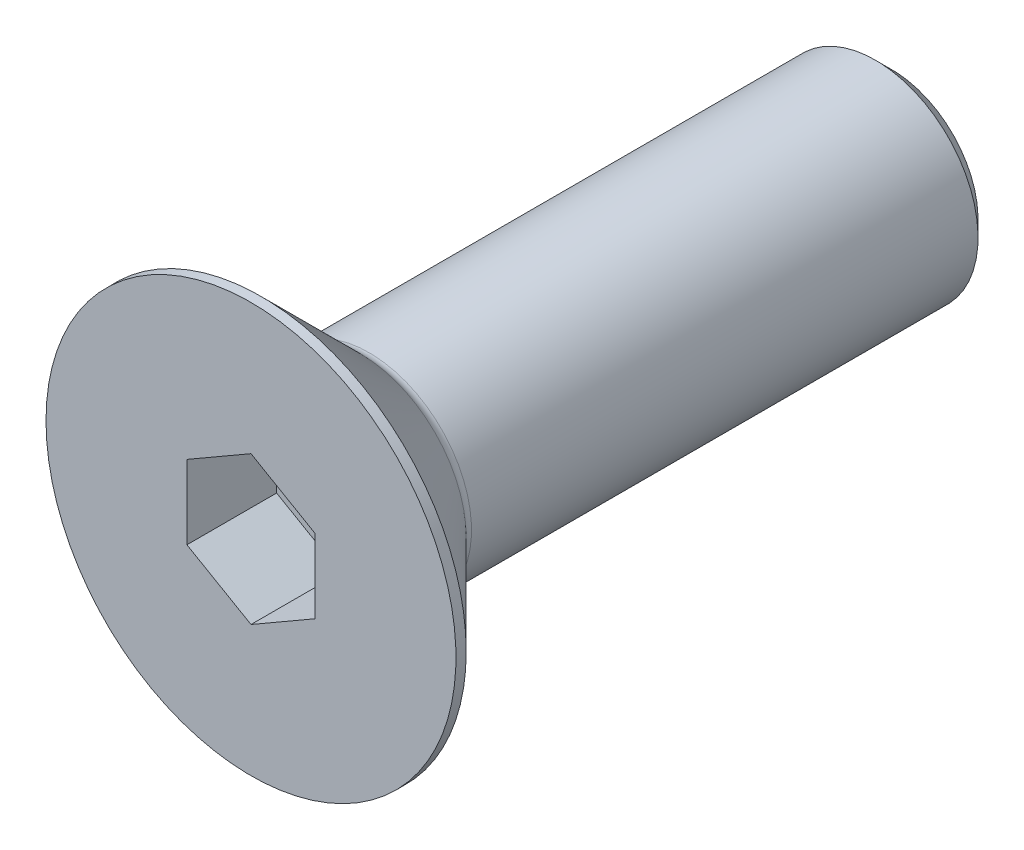
ISO-10303-21;
HEADER;
FILE_DESCRIPTION(('STEP AP214'),'2;1');
FILE_NAME('part.step','',(''),(''),'','','');
FILE_SCHEMA(('AUTOMOTIVE_DESIGN { 1 0 10303 214 1 1 1 1 }'));
ENDSEC;
DATA;
#1=APPLICATION_CONTEXT('core data for automotive mechanical design processes');
#2=APPLICATION_PROTOCOL_DEFINITION('international standard','automotive_design',2000,#1);
#3=PRODUCT_CONTEXT('',#1,'mechanical');
#4=PRODUCT('Part','Part','',(#3));
#5=PRODUCT_RELATED_PRODUCT_CATEGORY('part','',(#4));
#6=PRODUCT_DEFINITION_FORMATION('','',#4);
#7=PRODUCT_DEFINITION_CONTEXT('part definition',#1,'design');
#8=PRODUCT_DEFINITION('design','',#6,#7);
#9=PRODUCT_DEFINITION_SHAPE('','',#8);
#10=(LENGTH_UNIT() NAMED_UNIT(*) SI_UNIT(.MILLI.,.METRE.));
#11=(NAMED_UNIT(*) PLANE_ANGLE_UNIT() SI_UNIT($,.RADIAN.));
#12=(NAMED_UNIT(*) SI_UNIT($,.STERADIAN.) SOLID_ANGLE_UNIT());
#13=UNCERTAINTY_MEASURE_WITH_UNIT(LENGTH_MEASURE(1.E-05),#10,'distance_accuracy_value','');
#14=(GEOMETRIC_REPRESENTATION_CONTEXT(3) GLOBAL_UNCERTAINTY_ASSIGNED_CONTEXT((#13)) GLOBAL_UNIT_ASSIGNED_CONTEXT((#10,
#11,#12)) REPRESENTATION_CONTEXT('',''));
#15=CARTESIAN_POINT('',(0.,0.,0.));
#16=DIRECTION('',(0.,0.,1.));
#17=DIRECTION('',(1.,0.,0.));
#18=AXIS2_PLACEMENT_3D('',#15,#16,#17);
#19=CARTESIAN_POINT('',(0.,0.,-3.5));
#20=DIRECTION('',(0.,0.,1.));
#21=DIRECTION('',(1.,0.,0.));
#22=AXIS2_PLACEMENT_3D('',#19,#20,#21);
#23=PLANE('',#22);
#24=DIRECTION('',(-0.866025403784439,-0.5,0.));
#25=VECTOR('',#24,1.);
#26=CARTESIAN_POINT('',(0.,2.88675134594813,-3.5));
#27=LINE('',#26,#25);
#28=CARTESIAN_POINT('',(0.,2.88675134594813,-3.5));
#29=VERTEX_POINT('',#28);
#30=CARTESIAN_POINT('',(-2.5,1.44337567297406,-3.5));
#31=VERTEX_POINT('',#30);
#32=EDGE_CURVE('E82',#29,#31,#27,.T.);
#33=ORIENTED_EDGE('',*,*,#32,.T.);
#34=DIRECTION('',(0.,1.,0.));
#35=VECTOR('',#34,1.);
#36=CARTESIAN_POINT('',(-2.5,1.44337567297406,-3.5));
#37=LINE('',#36,#35);
#38=CARTESIAN_POINT('',(-2.5,-1.44337567297407,-3.5));
#39=VERTEX_POINT('',#38);
#40=EDGE_CURVE('E66',#31,#39,#37,.F.);
#41=ORIENTED_EDGE('',*,*,#40,.T.);
#42=DIRECTION('',(0.866025403784439,-0.499999999999999,0.));
#43=VECTOR('',#42,1.);
#44=CARTESIAN_POINT('',(-2.5,-1.44337567297407,-3.5));
#45=LINE('',#44,#43);
#46=CARTESIAN_POINT('',(0.,-2.88675134594813,-3.5));
#47=VERTEX_POINT('',#46);
#48=EDGE_CURVE('E71',#39,#47,#45,.T.);
#49=ORIENTED_EDGE('',*,*,#48,.T.);
#50=DIRECTION('',(0.866025403784439,0.5,0.));
#51=VECTOR('',#50,1.);
#52=CARTESIAN_POINT('',(0.,-2.88675134594813,-3.5));
#53=LINE('',#52,#51);
#54=CARTESIAN_POINT('',(2.5,-1.44337567297406,-3.5));
#55=VERTEX_POINT('',#54);
#56=EDGE_CURVE('E128',#47,#55,#53,.T.);
#57=ORIENTED_EDGE('',*,*,#56,.T.);
#58=DIRECTION('',(0.,1.,0.));
#59=VECTOR('',#58,1.);
#60=CARTESIAN_POINT('',(2.5,-1.44337567297406,-3.5));
#61=LINE('',#60,#59);
#62=CARTESIAN_POINT('',(2.5,1.44337567297407,-3.5));
#63=VERTEX_POINT('',#62);
#64=EDGE_CURVE('E132',#55,#63,#61,.T.);
#65=ORIENTED_EDGE('',*,*,#64,.T.);
#66=DIRECTION('',(-0.866025403784439,0.499999999999999,0.));
#67=VECTOR('',#66,1.);
#68=CARTESIAN_POINT('',(2.5,1.44337567297407,-3.5));
#69=LINE('',#68,#67);
#70=EDGE_CURVE('E137',#63,#29,#69,.T.);
#71=ORIENTED_EDGE('',*,*,#70,.T.);
#72=EDGE_LOOP('',(#33,#41,#49,#57,#65,#71));
#73=FACE_BOUND('',#72,.T.);
#74=ADVANCED_FACE('F15',(#73),#23,.T.);
#75=CARTESIAN_POINT('',(-2.5,-1.44337567297407,0.));
#76=DIRECTION('',(-0.499999999999999,-0.866025403784439,0.));
#77=DIRECTION('',(0.866025403784439,-0.499999999999999,0.));
#78=AXIS2_PLACEMENT_3D('',#75,#76,#77);
#79=PLANE('',#78);
#80=DIRECTION('',(0.,0.,1.));
#81=VECTOR('',#80,1.);
#82=CARTESIAN_POINT('',(-2.5,-1.44337567297407,0.));
#83=LINE('',#82,#81);
#84=CARTESIAN_POINT('',(-2.5,-1.44337567297407,0.));
#85=VERTEX_POINT('',#84);
#86=EDGE_CURVE('E73',#39,#85,#83,.T.);
#87=ORIENTED_EDGE('',*,*,#86,.T.);
#88=DIRECTION('',(-0.866025403784439,0.499999999999999,0.));
#89=VECTOR('',#88,1.);
#90=CARTESIAN_POINT('',(0.,-2.88675134594813,0.));
#91=LINE('',#90,#89);
#92=CARTESIAN_POINT('',(0.,-2.88675134594813,0.));
#93=VERTEX_POINT('',#92);
#94=EDGE_CURVE('E126',#93,#85,#91,.T.);
#95=ORIENTED_EDGE('',*,*,#94,.F.);
#96=DIRECTION('',(0.,0.,1.));
#97=VECTOR('',#96,1.);
#98=CARTESIAN_POINT('',(0.,-2.88675134594813,0.));
#99=LINE('',#98,#97);
#100=EDGE_CURVE('E76',#93,#47,#99,.F.);
#101=ORIENTED_EDGE('',*,*,#100,.T.);
#102=ORIENTED_EDGE('',*,*,#48,.F.);
#103=EDGE_LOOP('',(#87,#95,#101,#102));
#104=FACE_BOUND('',#103,.T.);
#105=ADVANCED_FACE('F72',(#104),#79,.F.);
#106=CARTESIAN_POINT('',(-2.5,1.44337567297406,0.));
#107=DIRECTION('',(-1.,0.,0.));
#108=DIRECTION('',(0.,0.,1.));
#109=AXIS2_PLACEMENT_3D('',#106,#107,#108);
#110=PLANE('',#109);
#111=DIRECTION('',(0.,0.,1.));
#112=VECTOR('',#111,1.);
#113=CARTESIAN_POINT('',(-2.5,1.44337567297406,0.));
#114=LINE('',#113,#112);
#115=CARTESIAN_POINT('',(-2.5,1.44337567297406,0.));
#116=VERTEX_POINT('',#115);
#117=EDGE_CURVE('E84',#31,#116,#114,.T.);
#118=ORIENTED_EDGE('',*,*,#117,.T.);
#119=DIRECTION('',(0.,1.,0.));
#120=VECTOR('',#119,1.);
#121=CARTESIAN_POINT('',(-2.5,0.,0.));
#122=LINE('',#121,#120);
#123=EDGE_CURVE('E88',#85,#116,#122,.T.);
#124=ORIENTED_EDGE('',*,*,#123,.F.);
#125=ORIENTED_EDGE('',*,*,#86,.F.);
#126=ORIENTED_EDGE('',*,*,#40,.F.);
#127=EDGE_LOOP('',(#118,#124,#125,#126));
#128=FACE_BOUND('',#127,.T.);
#129=ADVANCED_FACE('F86',(#128),#110,.F.);
#130=CARTESIAN_POINT('',(0.,2.88675134594813,0.));
#131=DIRECTION('',(-0.5,0.866025403784439,0.));
#132=DIRECTION('',(-0.866025403784439,-0.5,0.));
#133=AXIS2_PLACEMENT_3D('',#130,#131,#132);
#134=PLANE('',#133);
#135=DIRECTION('',(0.,0.,1.));
#136=VECTOR('',#135,1.);
#137=CARTESIAN_POINT('',(0.,2.88675134594813,0.));
#138=LINE('',#137,#136);
#139=CARTESIAN_POINT('',(0.,2.88675134594813,0.));
#140=VERTEX_POINT('',#139);
#141=EDGE_CURVE('E139',#29,#140,#138,.T.);
#142=ORIENTED_EDGE('',*,*,#141,.T.);
#143=DIRECTION('',(0.866025403784439,0.499999999999999,0.));
#144=VECTOR('',#143,1.);
#145=CARTESIAN_POINT('',(-2.5,1.44337567297406,0.));
#146=LINE('',#145,#144);
#147=EDGE_CURVE('E122',#116,#140,#146,.T.);
#148=ORIENTED_EDGE('',*,*,#147,.F.);
#149=ORIENTED_EDGE('',*,*,#117,.F.);
#150=ORIENTED_EDGE('',*,*,#32,.F.);
#151=EDGE_LOOP('',(#142,#148,#149,#150));
#152=FACE_BOUND('',#151,.T.);
#153=ADVANCED_FACE('F143',(#152),#134,.F.);
#154=CARTESIAN_POINT('',(2.5,1.44337567297407,0.));
#155=DIRECTION('',(0.499999999999999,0.866025403784439,0.));
#156=DIRECTION('',(-0.866025403784439,0.499999999999999,0.));
#157=AXIS2_PLACEMENT_3D('',#154,#155,#156);
#158=PLANE('',#157);
#159=DIRECTION('',(0.,0.,-1.));
#160=VECTOR('',#159,1.);
#161=CARTESIAN_POINT('',(2.5,1.44337567297407,0.));
#162=LINE('',#161,#160);
#163=CARTESIAN_POINT('',(2.5,1.44337567297407,0.));
#164=VERTEX_POINT('',#163);
#165=EDGE_CURVE('E135',#63,#164,#162,.F.);
#166=ORIENTED_EDGE('',*,*,#165,.T.);
#167=DIRECTION('',(0.866025403784439,-0.499999999999999,0.));
#168=VECTOR('',#167,1.);
#169=CARTESIAN_POINT('',(0.,2.88675134594813,0.));
#170=LINE('',#169,#168);
#171=EDGE_CURVE('E119',#140,#164,#170,.T.);
#172=ORIENTED_EDGE('',*,*,#171,.F.);
#173=ORIENTED_EDGE('',*,*,#141,.F.);
#174=ORIENTED_EDGE('',*,*,#70,.F.);
#175=EDGE_LOOP('',(#166,#172,#173,#174));
#176=FACE_BOUND('',#175,.T.);
#177=ADVANCED_FACE('F154',(#176),#158,.F.);
#178=CARTESIAN_POINT('',(2.5,-1.44337567297406,0.));
#179=DIRECTION('',(1.,0.,0.));
#180=DIRECTION('',(0.,0.,-1.));
#181=AXIS2_PLACEMENT_3D('',#178,#179,#180);
#182=PLANE('',#181);
#183=DIRECTION('',(0.,0.,1.));
#184=VECTOR('',#183,1.);
#185=CARTESIAN_POINT('',(2.5,-1.44337567297406,0.));
#186=LINE('',#185,#184);
#187=CARTESIAN_POINT('',(2.5,-1.44337567297406,0.));
#188=VERTEX_POINT('',#187);
#189=EDGE_CURVE('E34',#55,#188,#186,.T.);
#190=ORIENTED_EDGE('',*,*,#189,.T.);
#191=DIRECTION('',(0.,1.,0.));
#192=VECTOR('',#191,1.);
#193=CARTESIAN_POINT('',(2.5,0.,0.));
#194=LINE('',#193,#192);
#195=EDGE_CURVE('E116',#164,#188,#194,.F.);
#196=ORIENTED_EDGE('',*,*,#195,.F.);
#197=ORIENTED_EDGE('',*,*,#165,.F.);
#198=ORIENTED_EDGE('',*,*,#64,.F.);
#199=EDGE_LOOP('',(#190,#196,#197,#198));
#200=FACE_BOUND('',#199,.T.);
#201=ADVANCED_FACE('F152',(#200),#182,.F.);
#202=CARTESIAN_POINT('',(0.,-2.88675134594813,0.));
#203=DIRECTION('',(0.5,-0.866025403784439,0.));
#204=DIRECTION('',(0.866025403784439,0.5,0.));
#205=AXIS2_PLACEMENT_3D('',#202,#203,#204);
#206=PLANE('',#205);
#207=ORIENTED_EDGE('',*,*,#100,.F.);
#208=DIRECTION('',(-0.866025403784439,-0.499999999999999,0.));
#209=VECTOR('',#208,1.);
#210=CARTESIAN_POINT('',(2.5,-1.44337567297406,0.));
#211=LINE('',#210,#209);
#212=EDGE_CURVE('E113',#188,#93,#211,.T.);
#213=ORIENTED_EDGE('',*,*,#212,.F.);
#214=ORIENTED_EDGE('',*,*,#189,.F.);
#215=ORIENTED_EDGE('',*,*,#56,.F.);
#216=EDGE_LOOP('',(#207,#213,#214,#215));
#217=FACE_BOUND('',#216,.T.);
#218=ADVANCED_FACE('F150',(#217),#206,.F.);
#219=CARTESIAN_POINT('',(4.,0.,0.));
#220=DIRECTION('',(0.,0.,1.));
#221=DIRECTION('',(1.,0.,0.));
#222=AXIS2_PLACEMENT_3D('',#219,#220,#221);
#223=PLANE('',#222);
#224=ORIENTED_EDGE('',*,*,#195,.T.);
#225=ORIENTED_EDGE('',*,*,#212,.T.);
#226=ORIENTED_EDGE('',*,*,#94,.T.);
#227=ORIENTED_EDGE('',*,*,#123,.T.);
#228=ORIENTED_EDGE('',*,*,#147,.T.);
#229=ORIENTED_EDGE('',*,*,#171,.T.);
#230=EDGE_LOOP('',(#224,#225,#226,#227,#228,#229));
#231=FACE_BOUND('',#230,.T.);
#232=CARTESIAN_POINT('',(0.,0.,0.));
#233=DIRECTION('',(0.,0.,-1.));
#234=DIRECTION('',(-1.,0.,0.));
#235=AXIS2_PLACEMENT_3D('',#232,#233,#234);
#236=CIRCLE('',#235,8.);
#237=CARTESIAN_POINT('',(-8.,0.,0.));
#238=VERTEX_POINT('',#237);
#239=EDGE_CURVE('E19',#238,#238,#236,.T.);
#240=ORIENTED_EDGE('',*,*,#239,.F.);
#241=EDGE_LOOP('',(#240));
#242=FACE_BOUND('',#241,.T.);
#243=ADVANCED_FACE('F147',(#231,#242),#223,.T.);
#244=CARTESIAN_POINT('',(0.,0.,-0.2));
#245=DIRECTION('',(0.,0.,-1.));
#246=DIRECTION('',(-1.,0.,0.));
#247=AXIS2_PLACEMENT_3D('',#244,#245,#246);
#248=CYLINDRICAL_SURFACE('',#247,8.);
#249=ORIENTED_EDGE('',*,*,#239,.T.);
#250=EDGE_LOOP('',(#249));
#251=FACE_BOUND('',#250,.T.);
#252=CARTESIAN_POINT('',(0.,0.,-0.399999998251133));
#253=DIRECTION('',(0.,0.,1.));
#254=DIRECTION('',(1.,0.,0.));
#255=AXIS2_PLACEMENT_3D('',#252,#253,#254);
#256=CIRCLE('',#255,7.99999999821921);
#257=CARTESIAN_POINT('',(7.99999999821921,0.,-0.399999998251133));
#258=VERTEX_POINT('',#257);
#259=EDGE_CURVE('E100',#258,#258,#256,.F.);
#260=ORIENTED_EDGE('',*,*,#259,.F.);
#261=EDGE_LOOP('',(#260));
#262=FACE_BOUND('',#261,.T.);
#263=ADVANCED_FACE('F183',(#251,#262),#248,.T.);
#264=CARTESIAN_POINT('',(0.,0.,-0.399999998251133));
#265=DIRECTION('',(0.,0.,1.));
#266=DIRECTION('',(1.,0.,0.));
#267=AXIS2_PLACEMENT_3D('',#264,#265,#266);
#268=CONICAL_SURFACE('',#267,7.99999999821921,0.785398162505018);
#269=CARTESIAN_POINT('',(0.,0.,-4.25355339059328));
#270=DIRECTION('',(0.,0.,-1.));
#271=DIRECTION('',(0.,1.,0.));
#272=AXIS2_PLACEMENT_3D('',#269,#270,#271);
#273=CIRCLE('',#272,4.14644660940673);
#274=CARTESIAN_POINT('',(0.,4.14644660940673,-4.25355339059328));
#275=VERTEX_POINT('',#274);
#276=EDGE_CURVE('E94',#275,#275,#273,.T.);
#277=ORIENTED_EDGE('',*,*,#276,.F.);
#278=EDGE_LOOP('',(#277));
#279=FACE_BOUND('',#278,.T.);
#280=ORIENTED_EDGE('',*,*,#259,.T.);
#281=EDGE_LOOP('',(#280));
#282=FACE_BOUND('',#281,.T.);
#283=ADVANCED_FACE('F179',(#279,#282),#268,.T.);
#284=CARTESIAN_POINT('',(2.,0.,-25.));
#285=DIRECTION('',(0.,0.,-1.));
#286=DIRECTION('',(-1.,0.,0.));
#287=AXIS2_PLACEMENT_3D('',#284,#285,#286);
#288=PLANE('',#287);
#289=CARTESIAN_POINT('',(0.,0.,-25.0000000003183));
#290=DIRECTION('',(0.,0.,1.));
#291=DIRECTION('',(0.,-1.,0.));
#292=AXIS2_PLACEMENT_3D('',#289,#290,#291);
#293=CIRCLE('',#292,3.37500000028967);
#294=CARTESIAN_POINT('',(0.,-3.37500000028967,-25.0000000003183));
#295=VERTEX_POINT('',#294);
#296=EDGE_CURVE('E92',#295,#295,#293,.T.);
#297=ORIENTED_EDGE('',*,*,#296,.F.);
#298=EDGE_LOOP('',(#297));
#299=FACE_BOUND('',#298,.T.);
#300=ADVANCED_FACE('F176',(#299),#288,.T.);
#301=CARTESIAN_POINT('',(0.,0.,-4.60710678118655));
#302=DIRECTION('',(0.,0.,-1.));
#303=DIRECTION('',(-1.,0.,0.));
#304=AXIS2_PLACEMENT_3D('',#301,#302,#303);
#305=TOROIDAL_SURFACE('',#304,4.5,0.5);
#306=CARTESIAN_POINT('',(0.,0.,-4.60710678118655));
#307=DIRECTION('',(0.,0.,-1.));
#308=DIRECTION('',(-1.,0.,0.));
#309=AXIS2_PLACEMENT_3D('',#306,#307,#308);
#310=CIRCLE('',#309,4.);
#311=CARTESIAN_POINT('',(-4.,0.,-4.60710678118655));
#312=VERTEX_POINT('',#311);
#313=EDGE_CURVE('E25',#312,#312,#310,.T.);
#314=ORIENTED_EDGE('',*,*,#313,.F.);
#315=EDGE_LOOP('',(#314));
#316=FACE_BOUND('',#315,.T.);
#317=ORIENTED_EDGE('',*,*,#276,.T.);
#318=EDGE_LOOP('',(#317));
#319=FACE_BOUND('',#318,.T.);
#320=ADVANCED_FACE('F17',(#316,#319),#305,.F.);
#321=CARTESIAN_POINT('',(0.,0.,-24.3749999997362));
#322=DIRECTION('',(0.,0.,1.));
#323=DIRECTION('',(0.,-1.,0.));
#324=AXIS2_PLACEMENT_3D('',#321,#322,#323);
#325=CONICAL_SURFACE('',#324,3.99999999973488,0.785398162487954);
#326=ORIENTED_EDGE('',*,*,#296,.T.);
#327=EDGE_LOOP('',(#326));
#328=FACE_BOUND('',#327,.T.);
#329=CARTESIAN_POINT('',(0.,0.,-24.375));
#330=DIRECTION('',(0.,0.,-1.));
#331=DIRECTION('',(-1.,0.,0.));
#332=AXIS2_PLACEMENT_3D('',#329,#330,#331);
#333=CIRCLE('',#332,4.);
#334=CARTESIAN_POINT('',(-4.,0.,-24.375));
#335=VERTEX_POINT('',#334);
#336=EDGE_CURVE('E10',#335,#335,#333,.F.);
#337=ORIENTED_EDGE('',*,*,#336,.F.);
#338=EDGE_LOOP('',(#337));
#339=FACE_BOUND('',#338,.T.);
#340=ADVANCED_FACE('F166',(#328,#339),#325,.T.);
#341=CARTESIAN_POINT('',(0.,0.,-14.7));
#342=DIRECTION('',(0.,0.,-1.));
#343=DIRECTION('',(-1.,0.,0.));
#344=AXIS2_PLACEMENT_3D('',#341,#342,#343);
#345=CYLINDRICAL_SURFACE('',#344,4.);
#346=ORIENTED_EDGE('',*,*,#336,.T.);
#347=EDGE_LOOP('',(#346));
#348=FACE_BOUND('',#347,.T.);
#349=ORIENTED_EDGE('',*,*,#313,.T.);
#350=EDGE_LOOP('',(#349));
#351=FACE_BOUND('',#350,.T.);
#352=ADVANCED_FACE('F164',(#348,#351),#345,.T.);
#353=CLOSED_SHELL('',(#74,#105,#129,#153,#177,#201,#218,#243,#263,#283,#300,#320,#340,#352));
#354=MANIFOLD_SOLID_BREP('B1',#353);
#355=ADVANCED_BREP_SHAPE_REPRESENTATION('',(#18,#354),#14);
#356=SHAPE_DEFINITION_REPRESENTATION(#9,#355);
ENDSEC;
END-ISO-10303-21;
